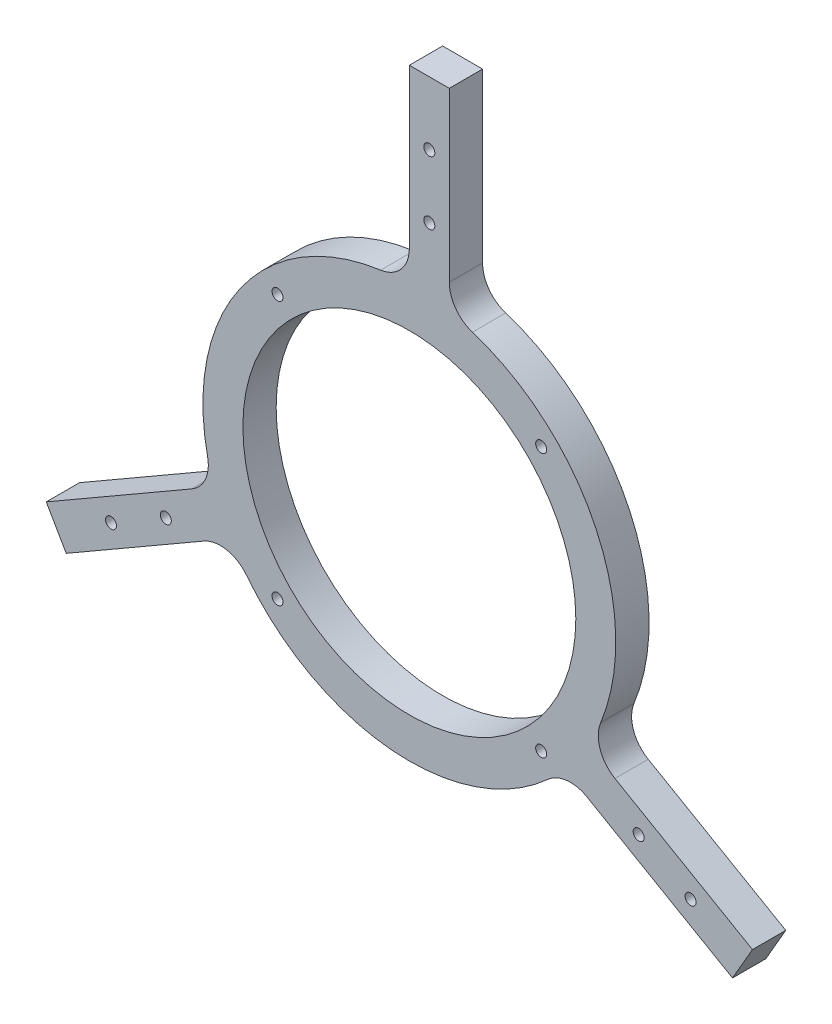
ISO-10303-21;
HEADER;
FILE_DESCRIPTION(('STEP AP214'),'2;1');
FILE_NAME('part.step','',(''),(''),'','','');
FILE_SCHEMA(('AUTOMOTIVE_DESIGN { 1 0 10303 214 1 1 1 1 }'));
ENDSEC;
DATA;
#1=APPLICATION_CONTEXT('core data for automotive mechanical design processes');
#2=APPLICATION_PROTOCOL_DEFINITION('international standard','automotive_design',2000,#1);
#3=PRODUCT_CONTEXT('',#1,'mechanical');
#4=PRODUCT('Part','Part','',(#3));
#5=PRODUCT_RELATED_PRODUCT_CATEGORY('part','',(#4));
#6=PRODUCT_DEFINITION_FORMATION('','',#4);
#7=PRODUCT_DEFINITION_CONTEXT('part definition',#1,'design');
#8=PRODUCT_DEFINITION('design','',#6,#7);
#9=PRODUCT_DEFINITION_SHAPE('','',#8);
#10=(LENGTH_UNIT() NAMED_UNIT(*) SI_UNIT(.MILLI.,.METRE.));
#11=(NAMED_UNIT(*) PLANE_ANGLE_UNIT() SI_UNIT($,.RADIAN.));
#12=(NAMED_UNIT(*) SI_UNIT($,.STERADIAN.) SOLID_ANGLE_UNIT());
#13=UNCERTAINTY_MEASURE_WITH_UNIT(LENGTH_MEASURE(1.E-05),#10,'distance_accuracy_value','');
#14=(GEOMETRIC_REPRESENTATION_CONTEXT(3) GLOBAL_UNCERTAINTY_ASSIGNED_CONTEXT((#13)) GLOBAL_UNIT_ASSIGNED_CONTEXT((#10,
#11,#12)) REPRESENTATION_CONTEXT('',''));
#15=CARTESIAN_POINT('',(0.,0.,0.));
#16=DIRECTION('',(0.,0.,1.));
#17=DIRECTION('',(1.,0.,0.));
#18=AXIS2_PLACEMENT_3D('',#15,#16,#17);
#19=CARTESIAN_POINT('',(0.,0.,10.));
#20=DIRECTION('',(0.5,-0.866025403784438,0.));
#21=DIRECTION('',(0.866025403784438,0.5,0.));
#22=AXIS2_PLACEMENT_3D('',#19,#20,#21);
#23=PLANE('',#22);
#24=DIRECTION('',(-0.866025403784438,-0.5,0.));
#25=VECTOR('',#24,1.);
#26=CARTESIAN_POINT('',(0.,0.,0.));
#27=LINE('',#26,#25);
#28=CARTESIAN_POINT('',(-61.7494939250517,-35.6510869399518,0.));
#29=VERTEX_POINT('',#28);
#30=CARTESIAN_POINT('',(-103.057023050348,-59.5000000000001,0.));
#31=VERTEX_POINT('',#30);
#32=EDGE_CURVE('E240',#29,#31,#27,.T.);
#33=ORIENTED_EDGE('',*,*,#32,.F.);
#34=DIRECTION('',(0.,0.,-1.));
#35=VECTOR('',#34,1.);
#36=CARTESIAN_POINT('',(-61.7494939250517,-35.6510869399518,10.));
#37=LINE('',#36,#35);
#38=CARTESIAN_POINT('',(-61.7494939250517,-35.6510869399518,10.));
#39=VERTEX_POINT('',#38);
#40=EDGE_CURVE('E381',#29,#39,#37,.F.);
#41=ORIENTED_EDGE('',*,*,#40,.T.);
#42=DIRECTION('',(-0.866025403784438,-0.5,0.));
#43=VECTOR('',#42,1.);
#44=CARTESIAN_POINT('',(0.,0.,10.));
#45=LINE('',#44,#43);
#46=CARTESIAN_POINT('',(-103.057023050348,-59.5000000000001,10.));
#47=VERTEX_POINT('',#46);
#48=EDGE_CURVE('E204',#39,#47,#45,.T.);
#49=ORIENTED_EDGE('',*,*,#48,.T.);
#50=DIRECTION('',(0.,0.,-1.));
#51=VECTOR('',#50,1.);
#52=CARTESIAN_POINT('',(-103.057023050348,-59.5000000000001,10.));
#53=LINE('',#52,#51);
#54=EDGE_CURVE('E235',#47,#31,#53,.T.);
#55=ORIENTED_EDGE('',*,*,#54,.T.);
#56=EDGE_LOOP('',(#33,#41,#49,#55));
#57=FACE_BOUND('',#56,.T.);
#58=ADVANCED_FACE('F44',(#57),#23,.T.);
#59=CARTESIAN_POINT('',(0.,0.,10.));
#60=DIRECTION('',(0.,0.,-1.));
#61=DIRECTION('',(-1.,0.,0.));
#62=AXIS2_PLACEMENT_3D('',#59,#60,#61);
#63=CYLINDRICAL_SURFACE('',#62,62.);
#64=CARTESIAN_POINT('',(0.,0.,0.));
#65=DIRECTION('',(0.,0.,1.));
#66=DIRECTION('',(1.,0.,0.));
#67=AXIS2_PLACEMENT_3D('',#64,#65,#66);
#68=CIRCLE('',#67,62.);
#69=CARTESIAN_POINT('',(-48.8676197687945,-38.1569880642134,0.));
#70=VERTEX_POINT('',#69);
#71=CARTESIAN_POINT('',(41.653417319191,-45.9237719011986,0.));
#72=VERTEX_POINT('',#71);
#73=EDGE_CURVE('E244',#70,#72,#68,.T.);
#74=ORIENTED_EDGE('',*,*,#73,.T.);
#75=DIRECTION('',(0.,0.,-1.));
#76=VECTOR('',#75,1.);
#77=CARTESIAN_POINT('',(41.653417319191,-45.9237719011986,10.));
#78=LINE('',#77,#76);
#79=CARTESIAN_POINT('',(41.653417319191,-45.9237719011986,10.));
#80=VERTEX_POINT('',#79);
#81=EDGE_CURVE('E378',#72,#80,#78,.F.);
#82=ORIENTED_EDGE('',*,*,#81,.T.);
#83=CARTESIAN_POINT('',(0.,0.,10.));
#84=DIRECTION('',(0.,0.,1.));
#85=DIRECTION('',(1.,0.,0.));
#86=AXIS2_PLACEMENT_3D('',#83,#84,#85);
#87=CIRCLE('',#86,62.);
#88=CARTESIAN_POINT('',(-48.8676197687945,-38.1569880642134,10.));
#89=VERTEX_POINT('',#88);
#90=EDGE_CURVE('E201',#89,#80,#87,.T.);
#91=ORIENTED_EDGE('',*,*,#90,.F.);
#92=DIRECTION('',(0.,0.,-1.));
#93=VECTOR('',#92,1.);
#94=CARTESIAN_POINT('',(-48.8676197687945,-38.1569880642134,10.));
#95=LINE('',#94,#93);
#96=EDGE_CURVE('E374',#89,#70,#95,.T.);
#97=ORIENTED_EDGE('',*,*,#96,.T.);
#98=EDGE_LOOP('',(#74,#82,#91,#97));
#99=FACE_BOUND('',#98,.T.);
#100=ADVANCED_FACE('F518',(#99),#63,.T.);
#101=CARTESIAN_POINT('',(-6.00000000000004,-10.3923048454133,10.));
#102=DIRECTION('',(-0.5,-0.866025403784439,0.));
#103=DIRECTION('',(0.866025403784439,-0.5,0.));
#104=AXIS2_PLACEMENT_3D('',#101,#102,#103);
#105=PLANE('',#104);
#106=DIRECTION('',(-0.866025403784439,0.5,0.));
#107=VECTOR('',#106,1.);
#108=CARTESIAN_POINT('',(-6.00000000000004,-10.3923048454133,10.));
#109=LINE('',#108,#107);
#110=CARTESIAN_POINT('',(97.0570230503482,-69.8923048454133,10.));
#111=VERTEX_POINT('',#110);
#112=CARTESIAN_POINT('',(53.3717104351896,-44.6705778474185,10.));
#113=VERTEX_POINT('',#112);
#114=EDGE_CURVE('E175',#111,#113,#109,.T.);
#115=ORIENTED_EDGE('',*,*,#114,.T.);
#116=DIRECTION('',(0.,0.,-1.));
#117=VECTOR('',#116,1.);
#118=CARTESIAN_POINT('',(53.3717104351896,-44.6705778474185,10.));
#119=LINE('',#118,#117);
#120=CARTESIAN_POINT('',(53.3717104351896,-44.6705778474185,0.));
#121=VERTEX_POINT('',#120);
#122=EDGE_CURVE('E371',#113,#121,#119,.T.);
#123=ORIENTED_EDGE('',*,*,#122,.T.);
#124=DIRECTION('',(-0.866025403784439,0.5,0.));
#125=VECTOR('',#124,1.);
#126=CARTESIAN_POINT('',(-6.00000000000004,-10.3923048454133,0.));
#127=LINE('',#126,#125);
#128=CARTESIAN_POINT('',(97.0570230503482,-69.8923048454133,0.));
#129=VERTEX_POINT('',#128);
#130=EDGE_CURVE('E178',#129,#121,#127,.T.);
#131=ORIENTED_EDGE('',*,*,#130,.F.);
#132=DIRECTION('',(0.,0.,-1.));
#133=VECTOR('',#132,1.);
#134=CARTESIAN_POINT('',(97.0570230503482,-69.8923048454133,10.));
#135=LINE('',#134,#133);
#136=EDGE_CURVE('E170',#111,#129,#135,.T.);
#137=ORIENTED_EDGE('',*,*,#136,.F.);
#138=EDGE_LOOP('',(#115,#123,#131,#137));
#139=FACE_BOUND('',#138,.T.);
#140=ADVANCED_FACE('F172',(#139),#105,.T.);
#141=CARTESIAN_POINT('',(103.057023050348,-59.4999999999998,10.));
#142=DIRECTION('',(-0.866025403784439,0.499999999999999,0.));
#143=DIRECTION('',(-0.499999999999999,-0.86602540378444,0.));
#144=AXIS2_PLACEMENT_3D('',#141,#142,#143);
#145=PLANE('',#144);
#146=DIRECTION('',(0.499999999999999,0.86602540378444,0.));
#147=VECTOR('',#146,1.);
#148=CARTESIAN_POINT('',(103.057023050348,-59.4999999999998,0.));
#149=LINE('',#148,#147);
#150=CARTESIAN_POINT('',(103.057023050348,-59.4999999999999,0.));
#151=VERTEX_POINT('',#150);
#152=EDGE_CURVE('E250',#129,#151,#149,.T.);
#153=ORIENTED_EDGE('',*,*,#152,.T.);
#154=DIRECTION('',(0.,0.,-1.));
#155=VECTOR('',#154,1.);
#156=CARTESIAN_POINT('',(103.057023050348,-59.4999999999999,10.));
#157=LINE('',#156,#155);
#158=CARTESIAN_POINT('',(103.057023050348,-59.4999999999999,10.));
#159=VERTEX_POINT('',#158);
#160=EDGE_CURVE('E184',#159,#151,#157,.T.);
#161=ORIENTED_EDGE('',*,*,#160,.F.);
#162=DIRECTION('',(0.499999999999999,0.86602540378444,0.));
#163=VECTOR('',#162,1.);
#164=CARTESIAN_POINT('',(103.057023050348,-59.4999999999998,10.));
#165=LINE('',#164,#163);
#166=EDGE_CURVE('E188',#111,#159,#165,.T.);
#167=ORIENTED_EDGE('',*,*,#166,.F.);
#168=ORIENTED_EDGE('',*,*,#136,.T.);
#169=EDGE_LOOP('',(#153,#161,#167,#168));
#170=FACE_BOUND('',#169,.T.);
#171=ADVANCED_FACE('F189',(#170),#145,.F.);
#172=CARTESIAN_POINT('',(0.,0.,10.));
#173=DIRECTION('',(0.5,0.866025403784439,0.));
#174=DIRECTION('',(-0.866025403784439,0.5,0.));
#175=AXIS2_PLACEMENT_3D('',#172,#173,#174);
#176=PLANE('',#175);
#177=DIRECTION('',(0.866025403784439,-0.5,0.));
#178=VECTOR('',#177,1.);
#179=CARTESIAN_POINT('',(0.,0.,0.));
#180=LINE('',#179,#178);
#181=CARTESIAN_POINT('',(61.7494939250518,-35.6510869399517,0.));
#182=VERTEX_POINT('',#181);
#183=EDGE_CURVE('E253',#182,#151,#180,.T.);
#184=ORIENTED_EDGE('',*,*,#183,.F.);
#185=DIRECTION('',(0.,0.,-1.));
#186=VECTOR('',#185,1.);
#187=CARTESIAN_POINT('',(61.7494939250518,-35.6510869399517,10.));
#188=LINE('',#187,#186);
#189=CARTESIAN_POINT('',(61.7494939250518,-35.6510869399517,10.));
#190=VERTEX_POINT('',#189);
#191=EDGE_CURVE('E368',#182,#190,#188,.F.);
#192=ORIENTED_EDGE('',*,*,#191,.T.);
#193=DIRECTION('',(0.866025403784439,-0.5,0.));
#194=VECTOR('',#193,1.);
#195=CARTESIAN_POINT('',(0.,0.,10.));
#196=LINE('',#195,#194);
#197=EDGE_CURVE('E193',#190,#159,#196,.T.);
#198=ORIENTED_EDGE('',*,*,#197,.T.);
#199=ORIENTED_EDGE('',*,*,#160,.T.);
#200=EDGE_LOOP('',(#184,#192,#198,#199));
#201=FACE_BOUND('',#200,.T.);
#202=ADVANCED_FACE('F556',(#201),#176,.T.);
#203=CARTESIAN_POINT('',(0.,0.,10.));
#204=DIRECTION('',(0.,0.,-1.));
#205=DIRECTION('',(-1.,0.,0.));
#206=AXIS2_PLACEMENT_3D('',#203,#204,#205);
#207=CYLINDRICAL_SURFACE('',#206,62.);
#208=CARTESIAN_POINT('',(0.,0.,0.));
#209=DIRECTION('',(0.,0.,1.));
#210=DIRECTION('',(1.,0.,0.));
#211=AXIS2_PLACEMENT_3D('',#208,#209,#210);
#212=CIRCLE('',#211,62.);
#213=CARTESIAN_POINT('',(57.4787308799057,-23.242106110148,0.));
#214=VERTEX_POINT('',#213);
#215=CARTESIAN_POINT('',(18.9444444444445,59.0348035034534,0.));
#216=VERTEX_POINT('',#215);
#217=EDGE_CURVE('E256',#214,#216,#212,.T.);
#218=ORIENTED_EDGE('',*,*,#217,.T.);
#219=DIRECTION('',(0.,0.,-1.));
#220=VECTOR('',#219,1.);
#221=CARTESIAN_POINT('',(18.9444444444445,59.0348035034534,10.));
#222=LINE('',#221,#220);
#223=CARTESIAN_POINT('',(18.9444444444445,59.0348035034534,10.));
#224=VERTEX_POINT('',#223);
#225=EDGE_CURVE('E365',#216,#224,#222,.F.);
#226=ORIENTED_EDGE('',*,*,#225,.T.);
#227=CARTESIAN_POINT('',(0.,0.,10.));
#228=DIRECTION('',(0.,0.,1.));
#229=DIRECTION('',(1.,0.,0.));
#230=AXIS2_PLACEMENT_3D('',#227,#228,#229);
#231=CIRCLE('',#230,62.);
#232=CARTESIAN_POINT('',(57.4787308799057,-23.242106110148,10.));
#233=VERTEX_POINT('',#232);
#234=EDGE_CURVE('E210',#233,#224,#231,.T.);
#235=ORIENTED_EDGE('',*,*,#234,.F.);
#236=DIRECTION('',(0.,0.,-1.));
#237=VECTOR('',#236,1.);
#238=CARTESIAN_POINT('',(57.4787308799057,-23.242106110148,10.));
#239=LINE('',#238,#237);
#240=EDGE_CURVE('E361',#233,#214,#239,.T.);
#241=ORIENTED_EDGE('',*,*,#240,.T.);
#242=EDGE_LOOP('',(#218,#226,#235,#241));
#243=FACE_BOUND('',#242,.T.);
#244=ADVANCED_FACE('F561',(#243),#207,.T.);
#245=CARTESIAN_POINT('',(12.,0.,10.));
#246=DIRECTION('',(1.,0.,0.));
#247=DIRECTION('',(0.,1.,0.));
#248=AXIS2_PLACEMENT_3D('',#245,#246,#247);
#249=PLANE('',#248);
#250=DIRECTION('',(0.,-1.,0.));
#251=VECTOR('',#250,1.);
#252=CARTESIAN_POINT('',(12.,0.,10.));
#253=LINE('',#252,#251);
#254=CARTESIAN_POINT('',(12.,119.,10.));
#255=VERTEX_POINT('',#254);
#256=CARTESIAN_POINT('',(12.,68.5565460040104,10.));
#257=VERTEX_POINT('',#256);
#258=EDGE_CURVE('E214',#255,#257,#253,.T.);
#259=ORIENTED_EDGE('',*,*,#258,.T.);
#260=DIRECTION('',(0.,0.,-1.));
#261=VECTOR('',#260,1.);
#262=CARTESIAN_POINT('',(12.,68.5565460040104,10.));
#263=LINE('',#262,#261);
#264=CARTESIAN_POINT('',(12.,68.5565460040104,0.));
#265=VERTEX_POINT('',#264);
#266=EDGE_CURVE('E357',#257,#265,#263,.T.);
#267=ORIENTED_EDGE('',*,*,#266,.T.);
#268=DIRECTION('',(0.,-1.,0.));
#269=VECTOR('',#268,1.);
#270=CARTESIAN_POINT('',(12.,0.,0.));
#271=LINE('',#270,#269);
#272=CARTESIAN_POINT('',(12.,119.,0.));
#273=VERTEX_POINT('',#272);
#274=EDGE_CURVE('E260',#273,#265,#271,.T.);
#275=ORIENTED_EDGE('',*,*,#274,.F.);
#276=DIRECTION('',(0.,0.,-1.));
#277=VECTOR('',#276,1.);
#278=CARTESIAN_POINT('',(12.,119.,10.));
#279=LINE('',#278,#277);
#280=EDGE_CURVE('E294',#255,#273,#279,.T.);
#281=ORIENTED_EDGE('',*,*,#280,.F.);
#282=EDGE_LOOP('',(#259,#267,#275,#281));
#283=FACE_BOUND('',#282,.T.);
#284=ADVANCED_FACE('F567',(#283),#249,.T.);
#285=CARTESIAN_POINT('',(0.,119.,10.));
#286=DIRECTION('',(0.,1.,0.));
#287=DIRECTION('',(0.,0.,1.));
#288=AXIS2_PLACEMENT_3D('',#285,#286,#287);
#289=PLANE('',#288);
#290=DIRECTION('',(1.,0.,0.));
#291=VECTOR('',#290,1.);
#292=CARTESIAN_POINT('',(0.,119.,0.));
#293=LINE('',#292,#291);
#294=CARTESIAN_POINT('',(0.,119.,0.));
#295=VERTEX_POINT('',#294);
#296=EDGE_CURVE('E264',#295,#273,#293,.T.);
#297=ORIENTED_EDGE('',*,*,#296,.F.);
#298=DIRECTION('',(0.,0.,-1.));
#299=VECTOR('',#298,1.);
#300=CARTESIAN_POINT('',(0.,119.,10.));
#301=LINE('',#300,#299);
#302=CARTESIAN_POINT('',(0.,119.,10.));
#303=VERTEX_POINT('',#302);
#304=EDGE_CURVE('E290',#303,#295,#301,.T.);
#305=ORIENTED_EDGE('',*,*,#304,.F.);
#306=DIRECTION('',(1.,0.,0.));
#307=VECTOR('',#306,1.);
#308=CARTESIAN_POINT('',(0.,119.,10.));
#309=LINE('',#308,#307);
#310=EDGE_CURVE('E218',#303,#255,#309,.T.);
#311=ORIENTED_EDGE('',*,*,#310,.T.);
#312=ORIENTED_EDGE('',*,*,#280,.T.);
#313=EDGE_LOOP('',(#297,#305,#311,#312));
#314=FACE_BOUND('',#313,.T.);
#315=ADVANCED_FACE('F574',(#314),#289,.T.);
#316=CARTESIAN_POINT('',(0.,0.,10.));
#317=DIRECTION('',(-1.,0.,0.));
#318=DIRECTION('',(0.,-1.,0.));
#319=AXIS2_PLACEMENT_3D('',#316,#317,#318);
#320=PLANE('',#319);
#321=DIRECTION('',(0.,1.,0.));
#322=VECTOR('',#321,1.);
#323=CARTESIAN_POINT('',(0.,0.,0.));
#324=LINE('',#323,#322);
#325=CARTESIAN_POINT('',(0.,71.3021738799035,0.));
#326=VERTEX_POINT('',#325);
#327=EDGE_CURVE('E268',#326,#295,#324,.T.);
#328=ORIENTED_EDGE('',*,*,#327,.F.);
#329=DIRECTION('',(0.,0.,-1.));
#330=VECTOR('',#329,1.);
#331=CARTESIAN_POINT('',(0.,71.3021738799035,10.));
#332=LINE('',#331,#330);
#333=CARTESIAN_POINT('',(0.,71.3021738799035,10.));
#334=VERTEX_POINT('',#333);
#335=EDGE_CURVE('E354',#326,#334,#332,.F.);
#336=ORIENTED_EDGE('',*,*,#335,.T.);
#337=DIRECTION('',(0.,1.,0.));
#338=VECTOR('',#337,1.);
#339=CARTESIAN_POINT('',(0.,0.,10.));
#340=LINE('',#339,#338);
#341=EDGE_CURVE('E222',#334,#303,#340,.T.);
#342=ORIENTED_EDGE('',*,*,#341,.T.);
#343=ORIENTED_EDGE('',*,*,#304,.T.);
#344=EDGE_LOOP('',(#328,#336,#342,#343));
#345=FACE_BOUND('',#344,.T.);
#346=ADVANCED_FACE('F577',(#345),#320,.T.);
#347=CARTESIAN_POINT('',(0.,0.,10.));
#348=DIRECTION('',(0.,0.,-1.));
#349=DIRECTION('',(-1.,0.,0.));
#350=AXIS2_PLACEMENT_3D('',#347,#348,#349);
#351=CYLINDRICAL_SURFACE('',#350,62.);
#352=CARTESIAN_POINT('',(0.,0.,10.));
#353=DIRECTION('',(0.,0.,1.));
#354=DIRECTION('',(1.,0.,0.));
#355=AXIS2_PLACEMENT_3D('',#352,#353,#354);
#356=CIRCLE('',#355,62.);
#357=CARTESIAN_POINT('',(-8.61111111111111,61.3990941743614,10.));
#358=VERTEX_POINT('',#357);
#359=CARTESIAN_POINT('',(-60.5978617636355,-13.1110316022549,10.));
#360=VERTEX_POINT('',#359);
#361=EDGE_CURVE('E225',#358,#360,#356,.T.);
#362=ORIENTED_EDGE('',*,*,#361,.F.);
#363=DIRECTION('',(0.,0.,-1.));
#364=VECTOR('',#363,1.);
#365=CARTESIAN_POINT('',(-8.61111111111111,61.3990941743614,10.));
#366=LINE('',#365,#364);
#367=CARTESIAN_POINT('',(-8.61111111111111,61.3990941743614,0.));
#368=VERTEX_POINT('',#367);
#369=EDGE_CURVE('E350',#358,#368,#366,.T.);
#370=ORIENTED_EDGE('',*,*,#369,.T.);
#371=CARTESIAN_POINT('',(0.,0.,0.));
#372=DIRECTION('',(0.,0.,1.));
#373=DIRECTION('',(1.,0.,0.));
#374=AXIS2_PLACEMENT_3D('',#371,#372,#373);
#375=CIRCLE('',#374,62.);
#376=CARTESIAN_POINT('',(-60.5978617636355,-13.1110316022549,0.));
#377=VERTEX_POINT('',#376);
#378=EDGE_CURVE('E271',#368,#377,#375,.T.);
#379=ORIENTED_EDGE('',*,*,#378,.T.);
#380=DIRECTION('',(0.,0.,-1.));
#381=VECTOR('',#380,1.);
#382=CARTESIAN_POINT('',(-60.5978617636355,-13.1110316022549,10.));
#383=LINE('',#382,#381);
#384=EDGE_CURVE('E183',#377,#360,#383,.F.);
#385=ORIENTED_EDGE('',*,*,#384,.T.);
#386=EDGE_LOOP('',(#362,#370,#379,#385));
#387=FACE_BOUND('',#386,.T.);
#388=ADVANCED_FACE('F423',(#387),#351,.T.);
#389=CARTESIAN_POINT('',(-5.99999999999998,10.3923048454132,10.));
#390=DIRECTION('',(-0.5,0.866025403784439,0.));
#391=DIRECTION('',(-0.866025403784439,-0.5,0.));
#392=AXIS2_PLACEMENT_3D('',#389,#390,#391);
#393=PLANE('',#392);
#394=DIRECTION('',(0.866025403784439,0.5,0.));
#395=VECTOR('',#394,1.);
#396=CARTESIAN_POINT('',(-5.99999999999998,10.3923048454132,10.));
#397=LINE('',#396,#395);
#398=CARTESIAN_POINT('',(-109.057023050348,-49.1076951545868,10.));
#399=VERTEX_POINT('',#398);
#400=CARTESIAN_POINT('',(-65.3717104351896,-23.885968156592,10.));
#401=VERTEX_POINT('',#400);
#402=EDGE_CURVE('E228',#399,#401,#397,.T.);
#403=ORIENTED_EDGE('',*,*,#402,.T.);
#404=DIRECTION('',(0.,0.,-1.));
#405=VECTOR('',#404,1.);
#406=CARTESIAN_POINT('',(-65.3717104351896,-23.885968156592,10.));
#407=LINE('',#406,#405);
#408=CARTESIAN_POINT('',(-65.3717104351896,-23.885968156592,0.));
#409=VERTEX_POINT('',#408);
#410=EDGE_CURVE('E384',#401,#409,#407,.T.);
#411=ORIENTED_EDGE('',*,*,#410,.T.);
#412=DIRECTION('',(0.866025403784439,0.5,0.));
#413=VECTOR('',#412,1.);
#414=CARTESIAN_POINT('',(-5.99999999999998,10.3923048454132,0.));
#415=LINE('',#414,#413);
#416=CARTESIAN_POINT('',(-109.057023050348,-49.1076951545868,0.));
#417=VERTEX_POINT('',#416);
#418=EDGE_CURVE('E275',#417,#409,#415,.T.);
#419=ORIENTED_EDGE('',*,*,#418,.F.);
#420=DIRECTION('',(0.,0.,-1.));
#421=VECTOR('',#420,1.);
#422=CARTESIAN_POINT('',(-109.057023050348,-49.1076951545868,10.));
#423=LINE('',#422,#421);
#424=EDGE_CURVE('E287',#399,#417,#423,.T.);
#425=ORIENTED_EDGE('',*,*,#424,.F.);
#426=EDGE_LOOP('',(#403,#411,#419,#425));
#427=FACE_BOUND('',#426,.T.);
#428=ADVANCED_FACE('F426',(#427),#393,.T.);
#429=CARTESIAN_POINT('',(0.,0.,10.));
#430=DIRECTION('',(0.,0.,-1.));
#431=DIRECTION('',(-1.,0.,0.));
#432=AXIS2_PLACEMENT_3D('',#429,#430,#431);
#433=CYLINDRICAL_SURFACE('',#432,50.);
#434=CARTESIAN_POINT('',(0.,0.,10.));
#435=DIRECTION('',(0.,0.,1.));
#436=DIRECTION('',(1.,0.,0.));
#437=AXIS2_PLACEMENT_3D('',#434,#435,#436);
#438=CIRCLE('',#437,50.);
#439=CARTESIAN_POINT('',(50.,0.,10.));
#440=VERTEX_POINT('',#439);
#441=EDGE_CURVE('E283',#440,#440,#438,.T.);
#442=ORIENTED_EDGE('',*,*,#441,.T.);
#443=EDGE_LOOP('',(#442));
#444=FACE_BOUND('',#443,.T.);
#445=CARTESIAN_POINT('',(0.,0.,0.));
#446=DIRECTION('',(0.,0.,1.));
#447=DIRECTION('',(1.,0.,0.));
#448=AXIS2_PLACEMENT_3D('',#445,#446,#447);
#449=CIRCLE('',#448,50.);
#450=CARTESIAN_POINT('',(50.,0.,0.));
#451=VERTEX_POINT('',#450);
#452=EDGE_CURVE('E236',#451,#451,#449,.T.);
#453=ORIENTED_EDGE('',*,*,#452,.F.);
#454=EDGE_LOOP('',(#453));
#455=FACE_BOUND('',#454,.T.);
#456=ADVANCED_FACE('F498',(#444,#455),#433,.F.);
#457=CARTESIAN_POINT('',(-103.057023050348,-59.5000000000001,10.));
#458=DIRECTION('',(-0.866025403784438,-0.500000000000001,0.));
#459=DIRECTION('',(0.500000000000001,-0.866025403784438,0.));
#460=AXIS2_PLACEMENT_3D('',#457,#458,#459);
#461=PLANE('',#460);
#462=DIRECTION('',(-0.500000000000001,0.866025403784438,0.));
#463=VECTOR('',#462,1.);
#464=CARTESIAN_POINT('',(-103.057023050348,-59.5000000000001,0.));
#465=LINE('',#464,#463);
#466=EDGE_CURVE('E279',#31,#417,#465,.T.);
#467=ORIENTED_EDGE('',*,*,#466,.F.);
#468=ORIENTED_EDGE('',*,*,#54,.F.);
#469=DIRECTION('',(-0.500000000000001,0.866025403784438,0.));
#470=VECTOR('',#469,1.);
#471=CARTESIAN_POINT('',(-103.057023050348,-59.5000000000001,10.));
#472=LINE('',#471,#470);
#473=EDGE_CURVE('E231',#47,#399,#472,.T.);
#474=ORIENTED_EDGE('',*,*,#473,.T.);
#475=ORIENTED_EDGE('',*,*,#424,.T.);
#476=EDGE_LOOP('',(#467,#468,#474,#475));
#477=FACE_BOUND('',#476,.T.);
#478=ADVANCED_FACE('F431',(#477),#461,.T.);
#479=CARTESIAN_POINT('',(0.,0.,10.));
#480=DIRECTION('',(0.,0.,1.));
#481=DIRECTION('',(1.,0.,0.));
#482=AXIS2_PLACEMENT_3D('',#479,#480,#481);
#483=PLANE('',#482);
#484=CARTESIAN_POINT('',(-39.5979797464469,39.5979797464465,10.));
#485=DIRECTION('',(0.,0.,1.));
#486=DIRECTION('',(1.,0.,0.));
#487=AXIS2_PLACEMENT_3D('',#484,#485,#486);
#488=CIRCLE('',#487,1.64999999999999);
#489=CARTESIAN_POINT('',(-37.9479797464469,39.5979797464465,10.));
#490=VERTEX_POINT('',#489);
#491=EDGE_CURVE('E347',#490,#490,#488,.T.);
#492=ORIENTED_EDGE('',*,*,#491,.F.);
#493=EDGE_LOOP('',(#492));
#494=FACE_BOUND('',#493,.T.);
#495=CARTESIAN_POINT('',(-39.5979797464463,-39.597979746447,10.));
#496=DIRECTION('',(0.,0.,1.));
#497=DIRECTION('',(1.,0.,0.));
#498=AXIS2_PLACEMENT_3D('',#495,#496,#497);
#499=CIRCLE('',#498,1.64999999999999);
#500=CARTESIAN_POINT('',(-37.9479797464463,-39.597979746447,10.));
#501=VERTEX_POINT('',#500);
#502=EDGE_CURVE('E342',#501,#501,#499,.T.);
#503=ORIENTED_EDGE('',*,*,#502,.F.);
#504=EDGE_LOOP('',(#503));
#505=FACE_BOUND('',#504,.T.);
#506=CARTESIAN_POINT('',(39.5979797464467,-39.5979797464466,10.));
#507=DIRECTION('',(0.,0.,1.));
#508=DIRECTION('',(1.,0.,0.));
#509=AXIS2_PLACEMENT_3D('',#506,#507,#508);
#510=CIRCLE('',#509,1.64999999999999);
#511=CARTESIAN_POINT('',(41.2479797464467,-39.5979797464466,10.));
#512=VERTEX_POINT('',#511);
#513=EDGE_CURVE('E337',#512,#512,#510,.T.);
#514=ORIENTED_EDGE('',*,*,#513,.F.);
#515=EDGE_LOOP('',(#514));
#516=FACE_BOUND('',#515,.T.);
#517=CARTESIAN_POINT('',(39.5979797464466,39.5979797464467,10.));
#518=DIRECTION('',(0.,0.,1.));
#519=DIRECTION('',(1.,0.,0.));
#520=AXIS2_PLACEMENT_3D('',#517,#518,#519);
#521=CIRCLE('',#520,1.64999999999999);
#522=CARTESIAN_POINT('',(41.2479797464466,39.5979797464467,10.));
#523=VERTEX_POINT('',#522);
#524=EDGE_CURVE('E332',#523,#523,#521,.T.);
#525=ORIENTED_EDGE('',*,*,#524,.F.);
#526=EDGE_LOOP('',(#525));
#527=FACE_BOUND('',#526,.T.);
#528=CARTESIAN_POINT('',(-89.6025403784439,-44.8038475772934,10.));
#529=DIRECTION('',(0.,0.,1.));
#530=DIRECTION('',(1.,0.,0.));
#531=AXIS2_PLACEMENT_3D('',#528,#529,#530);
#532=CIRCLE('',#531,1.64999999999998);
#533=CARTESIAN_POINT('',(-87.9525403784439,-44.8038475772934,10.));
#534=VERTEX_POINT('',#533);
#535=EDGE_CURVE('E327',#534,#534,#532,.T.);
#536=ORIENTED_EDGE('',*,*,#535,.F.);
#537=EDGE_LOOP('',(#536));
#538=FACE_BOUND('',#537,.T.);
#539=CARTESIAN_POINT('',(-73.1480577065395,-35.3038475772934,10.));
#540=DIRECTION('',(0.,0.,1.));
#541=DIRECTION('',(1.,0.,0.));
#542=AXIS2_PLACEMENT_3D('',#539,#540,#541);
#543=CIRCLE('',#542,1.64999999999998);
#544=CARTESIAN_POINT('',(-71.4980577065396,-35.3038475772934,10.));
#545=VERTEX_POINT('',#544);
#546=EDGE_CURVE('E322',#545,#545,#543,.T.);
#547=ORIENTED_EDGE('',*,*,#546,.F.);
#548=EDGE_LOOP('',(#547));
#549=FACE_BOUND('',#548,.T.);
#550=CARTESIAN_POINT('',(84.4685657822283,-55.6961524227066,10.));
#551=DIRECTION('',(0.,0.,1.));
#552=DIRECTION('',(1.,0.,0.));
#553=AXIS2_PLACEMENT_3D('',#550,#551,#552);
#554=CIRCLE('',#553,1.64999999999998);
#555=CARTESIAN_POINT('',(86.1185657822283,-55.6961524227066,10.));
#556=VERTEX_POINT('',#555);
#557=EDGE_CURVE('E317',#556,#556,#554,.T.);
#558=ORIENTED_EDGE('',*,*,#557,.F.);
#559=EDGE_LOOP('',(#558));
#560=FACE_BOUND('',#559,.T.);
#561=CARTESIAN_POINT('',(68.8801085141084,-46.6961524227066,10.));
#562=DIRECTION('',(0.,0.,1.));
#563=DIRECTION('',(1.,0.,0.));
#564=AXIS2_PLACEMENT_3D('',#561,#562,#563);
#565=CIRCLE('',#564,1.64999999999998);
#566=CARTESIAN_POINT('',(70.5301085141084,-46.6961524227066,10.));
#567=VERTEX_POINT('',#566);
#568=EDGE_CURVE('E312',#567,#567,#565,.T.);
#569=ORIENTED_EDGE('',*,*,#568,.F.);
#570=EDGE_LOOP('',(#569));
#571=FACE_BOUND('',#570,.T.);
#572=CARTESIAN_POINT('',(6.00000000000001,81.,10.));
#573=DIRECTION('',(0.,0.,1.));
#574=DIRECTION('',(1.,0.,0.));
#575=AXIS2_PLACEMENT_3D('',#572,#573,#574);
#576=CIRCLE('',#575,1.64999999999999);
#577=CARTESIAN_POINT('',(7.65,81.,10.));
#578=VERTEX_POINT('',#577);
#579=EDGE_CURVE('E307',#578,#578,#576,.T.);
#580=ORIENTED_EDGE('',*,*,#579,.F.);
#581=EDGE_LOOP('',(#580));
#582=FACE_BOUND('',#581,.T.);
#583=CARTESIAN_POINT('',(6.00000000000001,100.,10.));
#584=DIRECTION('',(0.,0.,1.));
#585=DIRECTION('',(1.,0.,0.));
#586=AXIS2_PLACEMENT_3D('',#583,#584,#585);
#587=CIRCLE('',#586,1.64999999999999);
#588=CARTESIAN_POINT('',(7.65,100.,10.));
#589=VERTEX_POINT('',#588);
#590=EDGE_CURVE('E302',#589,#589,#587,.T.);
#591=ORIENTED_EDGE('',*,*,#590,.F.);
#592=EDGE_LOOP('',(#591));
#593=FACE_BOUND('',#592,.T.);
#594=ORIENTED_EDGE('',*,*,#441,.F.);
#595=EDGE_LOOP('',(#594));
#596=FACE_BOUND('',#595,.T.);
#597=ORIENTED_EDGE('',*,*,#48,.F.);
#598=CARTESIAN_POINT('',(-56.7494939250517,-44.3113409777962,10.));
#599=DIRECTION('',(0.,0.,1.));
#600=DIRECTION('',(1.,0.,0.));
#601=AXIS2_PLACEMENT_3D('',#598,#599,#600);
#602=CIRCLE('',#601,10.);
#603=EDGE_CURVE('E413',#39,#89,#602,.F.);
#604=ORIENTED_EDGE('',*,*,#603,.T.);
#605=ORIENTED_EDGE('',*,*,#90,.T.);
#606=CARTESIAN_POINT('',(48.3717104351895,-53.3308318852629,10.));
#607=DIRECTION('',(0.,0.,1.));
#608=DIRECTION('',(1.,0.,0.));
#609=AXIS2_PLACEMENT_3D('',#606,#607,#608);
#610=CIRCLE('',#609,10.);
#611=EDGE_CURVE('E199',#80,#113,#610,.F.);
#612=ORIENTED_EDGE('',*,*,#611,.T.);
#613=ORIENTED_EDGE('',*,*,#114,.F.);
#614=ORIENTED_EDGE('',*,*,#166,.T.);
#615=ORIENTED_EDGE('',*,*,#197,.F.);
#616=CARTESIAN_POINT('',(66.7494939250518,-26.9908329021073,10.));
#617=DIRECTION('',(0.,0.,1.));
#618=DIRECTION('',(1.,0.,0.));
#619=AXIS2_PLACEMENT_3D('',#616,#617,#618);
#620=CIRCLE('',#619,10.);
#621=EDGE_CURVE('E402',#190,#233,#620,.F.);
#622=ORIENTED_EDGE('',*,*,#621,.T.);
#623=ORIENTED_EDGE('',*,*,#234,.T.);
#624=CARTESIAN_POINT('',(22.,68.5565460040104,10.));
#625=DIRECTION('',(0.,0.,1.));
#626=DIRECTION('',(1.,0.,0.));
#627=AXIS2_PLACEMENT_3D('',#624,#625,#626);
#628=CIRCLE('',#627,10.);
#629=EDGE_CURVE('E396',#224,#257,#628,.F.);
#630=ORIENTED_EDGE('',*,*,#629,.T.);
#631=ORIENTED_EDGE('',*,*,#258,.F.);
#632=ORIENTED_EDGE('',*,*,#310,.F.);
#633=ORIENTED_EDGE('',*,*,#341,.F.);
#634=CARTESIAN_POINT('',(-10.,71.3021738799035,10.));
#635=DIRECTION('',(0.,0.,1.));
#636=DIRECTION('',(1.,0.,0.));
#637=AXIS2_PLACEMENT_3D('',#634,#635,#636);
#638=CIRCLE('',#637,10.);
#639=EDGE_CURVE('E390',#334,#358,#638,.F.);
#640=ORIENTED_EDGE('',*,*,#639,.T.);
#641=ORIENTED_EDGE('',*,*,#361,.T.);
#642=CARTESIAN_POINT('',(-70.3717104351896,-15.2257141187476,10.));
#643=DIRECTION('',(0.,0.,1.));
#644=DIRECTION('',(1.,0.,0.));
#645=AXIS2_PLACEMENT_3D('',#642,#643,#644);
#646=CIRCLE('',#645,10.);
#647=EDGE_CURVE('E11',#360,#401,#646,.F.);
#648=ORIENTED_EDGE('',*,*,#647,.T.);
#649=ORIENTED_EDGE('',*,*,#402,.F.);
#650=ORIENTED_EDGE('',*,*,#473,.F.);
#651=EDGE_LOOP('',(#597,#604,#605,#612,#613,#614,#615,#622,#623,#630,#631,#632,#633,#640,#641,
#648,#649,#650));
#652=FACE_BOUND('',#651,.T.);
#653=ADVANCED_FACE('F196',(#494,#505,#516,#527,#538,#549,#560,#571,#582,#593,#596,#652),#483,.T.);
#654=CARTESIAN_POINT('',(0.,0.,0.));
#655=DIRECTION('',(0.,0.,1.));
#656=DIRECTION('',(1.,0.,0.));
#657=AXIS2_PLACEMENT_3D('',#654,#655,#656);
#658=PLANE('',#657);
#659=CARTESIAN_POINT('',(-39.5979797464469,39.5979797464465,0.));
#660=DIRECTION('',(0.,0.,1.));
#661=DIRECTION('',(1.,0.,0.));
#662=AXIS2_PLACEMENT_3D('',#659,#660,#661);
#663=CIRCLE('',#662,1.64999999999999);
#664=CARTESIAN_POINT('',(-37.9479797464469,39.5979797464465,0.));
#665=VERTEX_POINT('',#664);
#666=EDGE_CURVE('E343',#665,#665,#663,.T.);
#667=ORIENTED_EDGE('',*,*,#666,.T.);
#668=EDGE_LOOP('',(#667));
#669=FACE_BOUND('',#668,.T.);
#670=CARTESIAN_POINT('',(-39.5979797464463,-39.597979746447,0.));
#671=DIRECTION('',(0.,0.,1.));
#672=DIRECTION('',(1.,0.,0.));
#673=AXIS2_PLACEMENT_3D('',#670,#671,#672);
#674=CIRCLE('',#673,1.64999999999999);
#675=CARTESIAN_POINT('',(-37.9479797464463,-39.597979746447,0.));
#676=VERTEX_POINT('',#675);
#677=EDGE_CURVE('E338',#676,#676,#674,.T.);
#678=ORIENTED_EDGE('',*,*,#677,.T.);
#679=EDGE_LOOP('',(#678));
#680=FACE_BOUND('',#679,.T.);
#681=CARTESIAN_POINT('',(39.5979797464467,-39.5979797464466,0.));
#682=DIRECTION('',(0.,0.,1.));
#683=DIRECTION('',(1.,0.,0.));
#684=AXIS2_PLACEMENT_3D('',#681,#682,#683);
#685=CIRCLE('',#684,1.64999999999999);
#686=CARTESIAN_POINT('',(41.2479797464467,-39.5979797464466,0.));
#687=VERTEX_POINT('',#686);
#688=EDGE_CURVE('E333',#687,#687,#685,.T.);
#689=ORIENTED_EDGE('',*,*,#688,.T.);
#690=EDGE_LOOP('',(#689));
#691=FACE_BOUND('',#690,.T.);
#692=CARTESIAN_POINT('',(39.5979797464466,39.5979797464467,0.));
#693=DIRECTION('',(0.,0.,1.));
#694=DIRECTION('',(1.,0.,0.));
#695=AXIS2_PLACEMENT_3D('',#692,#693,#694);
#696=CIRCLE('',#695,1.64999999999999);
#697=CARTESIAN_POINT('',(41.2479797464466,39.5979797464467,0.));
#698=VERTEX_POINT('',#697);
#699=EDGE_CURVE('E328',#698,#698,#696,.T.);
#700=ORIENTED_EDGE('',*,*,#699,.T.);
#701=EDGE_LOOP('',(#700));
#702=FACE_BOUND('',#701,.T.);
#703=CARTESIAN_POINT('',(-89.6025403784439,-44.8038475772934,0.));
#704=DIRECTION('',(0.,0.,1.));
#705=DIRECTION('',(1.,0.,0.));
#706=AXIS2_PLACEMENT_3D('',#703,#704,#705);
#707=CIRCLE('',#706,1.64999999999998);
#708=CARTESIAN_POINT('',(-87.9525403784439,-44.8038475772934,0.));
#709=VERTEX_POINT('',#708);
#710=EDGE_CURVE('E323',#709,#709,#707,.T.);
#711=ORIENTED_EDGE('',*,*,#710,.T.);
#712=EDGE_LOOP('',(#711));
#713=FACE_BOUND('',#712,.T.);
#714=CARTESIAN_POINT('',(-73.1480577065395,-35.3038475772934,0.));
#715=DIRECTION('',(0.,0.,1.));
#716=DIRECTION('',(1.,0.,0.));
#717=AXIS2_PLACEMENT_3D('',#714,#715,#716);
#718=CIRCLE('',#717,1.64999999999998);
#719=CARTESIAN_POINT('',(-71.4980577065396,-35.3038475772934,0.));
#720=VERTEX_POINT('',#719);
#721=EDGE_CURVE('E318',#720,#720,#718,.T.);
#722=ORIENTED_EDGE('',*,*,#721,.T.);
#723=EDGE_LOOP('',(#722));
#724=FACE_BOUND('',#723,.T.);
#725=CARTESIAN_POINT('',(84.4685657822283,-55.6961524227066,0.));
#726=DIRECTION('',(0.,0.,1.));
#727=DIRECTION('',(1.,0.,0.));
#728=AXIS2_PLACEMENT_3D('',#725,#726,#727);
#729=CIRCLE('',#728,1.64999999999998);
#730=CARTESIAN_POINT('',(86.1185657822283,-55.6961524227066,0.));
#731=VERTEX_POINT('',#730);
#732=EDGE_CURVE('E313',#731,#731,#729,.T.);
#733=ORIENTED_EDGE('',*,*,#732,.T.);
#734=EDGE_LOOP('',(#733));
#735=FACE_BOUND('',#734,.T.);
#736=CARTESIAN_POINT('',(68.8801085141084,-46.6961524227066,0.));
#737=DIRECTION('',(0.,0.,1.));
#738=DIRECTION('',(1.,0.,0.));
#739=AXIS2_PLACEMENT_3D('',#736,#737,#738);
#740=CIRCLE('',#739,1.64999999999998);
#741=CARTESIAN_POINT('',(70.5301085141084,-46.6961524227066,0.));
#742=VERTEX_POINT('',#741);
#743=EDGE_CURVE('E308',#742,#742,#740,.T.);
#744=ORIENTED_EDGE('',*,*,#743,.T.);
#745=EDGE_LOOP('',(#744));
#746=FACE_BOUND('',#745,.T.);
#747=CARTESIAN_POINT('',(6.00000000000001,81.,0.));
#748=DIRECTION('',(0.,0.,1.));
#749=DIRECTION('',(1.,0.,0.));
#750=AXIS2_PLACEMENT_3D('',#747,#748,#749);
#751=CIRCLE('',#750,1.64999999999999);
#752=CARTESIAN_POINT('',(7.65,81.,0.));
#753=VERTEX_POINT('',#752);
#754=EDGE_CURVE('E303',#753,#753,#751,.T.);
#755=ORIENTED_EDGE('',*,*,#754,.T.);
#756=EDGE_LOOP('',(#755));
#757=FACE_BOUND('',#756,.T.);
#758=CARTESIAN_POINT('',(6.00000000000001,100.,0.));
#759=DIRECTION('',(0.,0.,1.));
#760=DIRECTION('',(1.,0.,0.));
#761=AXIS2_PLACEMENT_3D('',#758,#759,#760);
#762=CIRCLE('',#761,1.64999999999999);
#763=CARTESIAN_POINT('',(7.65,100.,0.));
#764=VERTEX_POINT('',#763);
#765=EDGE_CURVE('E241',#764,#764,#762,.T.);
#766=ORIENTED_EDGE('',*,*,#765,.T.);
#767=EDGE_LOOP('',(#766));
#768=FACE_BOUND('',#767,.T.);
#769=ORIENTED_EDGE('',*,*,#452,.T.);
#770=EDGE_LOOP('',(#769));
#771=FACE_BOUND('',#770,.T.);
#772=ORIENTED_EDGE('',*,*,#73,.F.);
#773=CARTESIAN_POINT('',(-56.7494939250517,-44.3113409777962,0.));
#774=DIRECTION('',(0.,0.,1.));
#775=DIRECTION('',(1.,0.,0.));
#776=AXIS2_PLACEMENT_3D('',#773,#774,#775);
#777=CIRCLE('',#776,10.);
#778=EDGE_CURVE('E410',#70,#29,#777,.T.);
#779=ORIENTED_EDGE('',*,*,#778,.T.);
#780=ORIENTED_EDGE('',*,*,#32,.T.);
#781=ORIENTED_EDGE('',*,*,#466,.T.);
#782=ORIENTED_EDGE('',*,*,#418,.T.);
#783=CARTESIAN_POINT('',(-70.3717104351896,-15.2257141187476,0.));
#784=DIRECTION('',(0.,0.,1.));
#785=DIRECTION('',(1.,0.,0.));
#786=AXIS2_PLACEMENT_3D('',#783,#784,#785);
#787=CIRCLE('',#786,10.);
#788=EDGE_CURVE('E53',#409,#377,#787,.T.);
#789=ORIENTED_EDGE('',*,*,#788,.T.);
#790=ORIENTED_EDGE('',*,*,#378,.F.);
#791=CARTESIAN_POINT('',(-10.,71.3021738799035,0.));
#792=DIRECTION('',(0.,0.,1.));
#793=DIRECTION('',(1.,0.,0.));
#794=AXIS2_PLACEMENT_3D('',#791,#792,#793);
#795=CIRCLE('',#794,10.);
#796=EDGE_CURVE('E387',#368,#326,#795,.T.);
#797=ORIENTED_EDGE('',*,*,#796,.T.);
#798=ORIENTED_EDGE('',*,*,#327,.T.);
#799=ORIENTED_EDGE('',*,*,#296,.T.);
#800=ORIENTED_EDGE('',*,*,#274,.T.);
#801=CARTESIAN_POINT('',(22.,68.5565460040104,0.));
#802=DIRECTION('',(0.,0.,1.));
#803=DIRECTION('',(1.,0.,0.));
#804=AXIS2_PLACEMENT_3D('',#801,#802,#803);
#805=CIRCLE('',#804,10.);
#806=EDGE_CURVE('E393',#265,#216,#805,.T.);
#807=ORIENTED_EDGE('',*,*,#806,.T.);
#808=ORIENTED_EDGE('',*,*,#217,.F.);
#809=CARTESIAN_POINT('',(66.7494939250518,-26.9908329021073,0.));
#810=DIRECTION('',(0.,0.,1.));
#811=DIRECTION('',(1.,0.,0.));
#812=AXIS2_PLACEMENT_3D('',#809,#810,#811);
#813=CIRCLE('',#812,10.);
#814=EDGE_CURVE('E399',#214,#182,#813,.T.);
#815=ORIENTED_EDGE('',*,*,#814,.T.);
#816=ORIENTED_EDGE('',*,*,#183,.T.);
#817=ORIENTED_EDGE('',*,*,#152,.F.);
#818=ORIENTED_EDGE('',*,*,#130,.T.);
#819=CARTESIAN_POINT('',(48.3717104351895,-53.3308318852629,0.));
#820=DIRECTION('',(0.,0.,1.));
#821=DIRECTION('',(1.,0.,0.));
#822=AXIS2_PLACEMENT_3D('',#819,#820,#821);
#823=CIRCLE('',#822,10.);
#824=EDGE_CURVE('E405',#121,#72,#823,.T.);
#825=ORIENTED_EDGE('',*,*,#824,.T.);
#826=EDGE_LOOP('',(#772,#779,#780,#781,#782,#789,#790,#797,#798,#799,#800,#807,#808,#815,#816,
#817,#818,#825));
#827=FACE_BOUND('',#826,.T.);
#828=ADVANCED_FACE('F419',(#669,#680,#691,#702,#713,#724,#735,#746,#757,#768,#771,#827),#658,.F.);
#829=CARTESIAN_POINT('',(6.00000000000001,100.,10.));
#830=DIRECTION('',(0.,0.,1.));
#831=DIRECTION('',(1.,0.,0.));
#832=AXIS2_PLACEMENT_3D('',#829,#830,#831);
#833=CYLINDRICAL_SURFACE('',#832,1.64999999999999);
#834=ORIENTED_EDGE('',*,*,#590,.T.);
#835=EDGE_LOOP('',(#834));
#836=FACE_BOUND('',#835,.T.);
#837=ORIENTED_EDGE('',*,*,#765,.F.);
#838=EDGE_LOOP('',(#837));
#839=FACE_BOUND('',#838,.T.);
#840=ADVANCED_FACE('F505',(#836,#839),#833,.F.);
#841=CARTESIAN_POINT('',(6.00000000000001,81.,10.));
#842=DIRECTION('',(0.,0.,1.));
#843=DIRECTION('',(1.,0.,0.));
#844=AXIS2_PLACEMENT_3D('',#841,#842,#843);
#845=CYLINDRICAL_SURFACE('',#844,1.64999999999999);
#846=ORIENTED_EDGE('',*,*,#579,.T.);
#847=EDGE_LOOP('',(#846));
#848=FACE_BOUND('',#847,.T.);
#849=ORIENTED_EDGE('',*,*,#754,.F.);
#850=EDGE_LOOP('',(#849));
#851=FACE_BOUND('',#850,.T.);
#852=ADVANCED_FACE('F512',(#848,#851),#845,.F.);
#853=CARTESIAN_POINT('',(68.8801085141084,-46.6961524227066,10.));
#854=DIRECTION('',(0.,0.,1.));
#855=DIRECTION('',(1.,0.,0.));
#856=AXIS2_PLACEMENT_3D('',#853,#854,#855);
#857=CYLINDRICAL_SURFACE('',#856,1.64999999999998);
#858=ORIENTED_EDGE('',*,*,#568,.T.);
#859=EDGE_LOOP('',(#858));
#860=FACE_BOUND('',#859,.T.);
#861=ORIENTED_EDGE('',*,*,#743,.F.);
#862=EDGE_LOOP('',(#861));
#863=FACE_BOUND('',#862,.T.);
#864=ADVANCED_FACE('F674',(#860,#863),#857,.F.);
#865=CARTESIAN_POINT('',(84.4685657822283,-55.6961524227066,10.));
#866=DIRECTION('',(0.,0.,1.));
#867=DIRECTION('',(1.,0.,0.));
#868=AXIS2_PLACEMENT_3D('',#865,#866,#867);
#869=CYLINDRICAL_SURFACE('',#868,1.64999999999998);
#870=ORIENTED_EDGE('',*,*,#557,.T.);
#871=EDGE_LOOP('',(#870));
#872=FACE_BOUND('',#871,.T.);
#873=ORIENTED_EDGE('',*,*,#732,.F.);
#874=EDGE_LOOP('',(#873));
#875=FACE_BOUND('',#874,.T.);
#876=ADVANCED_FACE('F682',(#872,#875),#869,.F.);
#877=CARTESIAN_POINT('',(-73.1480577065395,-35.3038475772934,10.));
#878=DIRECTION('',(0.,0.,1.));
#879=DIRECTION('',(1.,0.,0.));
#880=AXIS2_PLACEMENT_3D('',#877,#878,#879);
#881=CYLINDRICAL_SURFACE('',#880,1.64999999999998);
#882=ORIENTED_EDGE('',*,*,#546,.T.);
#883=EDGE_LOOP('',(#882));
#884=FACE_BOUND('',#883,.T.);
#885=ORIENTED_EDGE('',*,*,#721,.F.);
#886=EDGE_LOOP('',(#885));
#887=FACE_BOUND('',#886,.T.);
#888=ADVANCED_FACE('F690',(#884,#887),#881,.F.);
#889=CARTESIAN_POINT('',(-89.6025403784439,-44.8038475772934,10.));
#890=DIRECTION('',(0.,0.,1.));
#891=DIRECTION('',(1.,0.,0.));
#892=AXIS2_PLACEMENT_3D('',#889,#890,#891);
#893=CYLINDRICAL_SURFACE('',#892,1.64999999999998);
#894=ORIENTED_EDGE('',*,*,#535,.T.);
#895=EDGE_LOOP('',(#894));
#896=FACE_BOUND('',#895,.T.);
#897=ORIENTED_EDGE('',*,*,#710,.F.);
#898=EDGE_LOOP('',(#897));
#899=FACE_BOUND('',#898,.T.);
#900=ADVANCED_FACE('F698',(#896,#899),#893,.F.);
#901=CARTESIAN_POINT('',(39.5979797464466,39.5979797464467,10.));
#902=DIRECTION('',(0.,0.,1.));
#903=DIRECTION('',(1.,0.,0.));
#904=AXIS2_PLACEMENT_3D('',#901,#902,#903);
#905=CYLINDRICAL_SURFACE('',#904,1.64999999999999);
#906=ORIENTED_EDGE('',*,*,#524,.T.);
#907=EDGE_LOOP('',(#906));
#908=FACE_BOUND('',#907,.T.);
#909=ORIENTED_EDGE('',*,*,#699,.F.);
#910=EDGE_LOOP('',(#909));
#911=FACE_BOUND('',#910,.T.);
#912=ADVANCED_FACE('F706',(#908,#911),#905,.F.);
#913=CARTESIAN_POINT('',(39.5979797464467,-39.5979797464466,10.));
#914=DIRECTION('',(0.,0.,1.));
#915=DIRECTION('',(1.,0.,0.));
#916=AXIS2_PLACEMENT_3D('',#913,#914,#915);
#917=CYLINDRICAL_SURFACE('',#916,1.64999999999999);
#918=ORIENTED_EDGE('',*,*,#513,.T.);
#919=EDGE_LOOP('',(#918));
#920=FACE_BOUND('',#919,.T.);
#921=ORIENTED_EDGE('',*,*,#688,.F.);
#922=EDGE_LOOP('',(#921));
#923=FACE_BOUND('',#922,.T.);
#924=ADVANCED_FACE('F714',(#920,#923),#917,.F.);
#925=CARTESIAN_POINT('',(-39.5979797464463,-39.597979746447,10.));
#926=DIRECTION('',(0.,0.,1.));
#927=DIRECTION('',(1.,0.,0.));
#928=AXIS2_PLACEMENT_3D('',#925,#926,#927);
#929=CYLINDRICAL_SURFACE('',#928,1.64999999999999);
#930=ORIENTED_EDGE('',*,*,#502,.T.);
#931=EDGE_LOOP('',(#930));
#932=FACE_BOUND('',#931,.T.);
#933=ORIENTED_EDGE('',*,*,#677,.F.);
#934=EDGE_LOOP('',(#933));
#935=FACE_BOUND('',#934,.T.);
#936=ADVANCED_FACE('F722',(#932,#935),#929,.F.);
#937=CARTESIAN_POINT('',(-39.5979797464469,39.5979797464465,10.));
#938=DIRECTION('',(0.,0.,1.));
#939=DIRECTION('',(1.,0.,0.));
#940=AXIS2_PLACEMENT_3D('',#937,#938,#939);
#941=CYLINDRICAL_SURFACE('',#940,1.64999999999999);
#942=ORIENTED_EDGE('',*,*,#491,.T.);
#943=EDGE_LOOP('',(#942));
#944=FACE_BOUND('',#943,.T.);
#945=ORIENTED_EDGE('',*,*,#666,.F.);
#946=EDGE_LOOP('',(#945));
#947=FACE_BOUND('',#946,.T.);
#948=ADVANCED_FACE('F472',(#944,#947),#941,.F.);
#949=CARTESIAN_POINT('',(-10.,71.3021738799035,10.));
#950=DIRECTION('',(0.,0.,-1.));
#951=DIRECTION('',(-1.,0.,0.));
#952=AXIS2_PLACEMENT_3D('',#949,#950,#951);
#953=CYLINDRICAL_SURFACE('',#952,10.);
#954=ORIENTED_EDGE('',*,*,#639,.F.);
#955=ORIENTED_EDGE('',*,*,#335,.F.);
#956=ORIENTED_EDGE('',*,*,#796,.F.);
#957=ORIENTED_EDGE('',*,*,#369,.F.);
#958=EDGE_LOOP('',(#954,#955,#956,#957));
#959=FACE_BOUND('',#958,.T.);
#960=ADVANCED_FACE('F528',(#959),#953,.F.);
#961=CARTESIAN_POINT('',(22.,68.5565460040104,10.));
#962=DIRECTION('',(0.,0.,-1.));
#963=DIRECTION('',(-1.,0.,0.));
#964=AXIS2_PLACEMENT_3D('',#961,#962,#963);
#965=CYLINDRICAL_SURFACE('',#964,10.);
#966=ORIENTED_EDGE('',*,*,#629,.F.);
#967=ORIENTED_EDGE('',*,*,#225,.F.);
#968=ORIENTED_EDGE('',*,*,#806,.F.);
#969=ORIENTED_EDGE('',*,*,#266,.F.);
#970=EDGE_LOOP('',(#966,#967,#968,#969));
#971=FACE_BOUND('',#970,.T.);
#972=ADVANCED_FACE('F531',(#971),#965,.F.);
#973=CARTESIAN_POINT('',(66.7494939250518,-26.9908329021073,10.));
#974=DIRECTION('',(0.,0.,-1.));
#975=DIRECTION('',(-1.,0.,0.));
#976=AXIS2_PLACEMENT_3D('',#973,#974,#975);
#977=CYLINDRICAL_SURFACE('',#976,10.);
#978=ORIENTED_EDGE('',*,*,#621,.F.);
#979=ORIENTED_EDGE('',*,*,#191,.F.);
#980=ORIENTED_EDGE('',*,*,#814,.F.);
#981=ORIENTED_EDGE('',*,*,#240,.F.);
#982=EDGE_LOOP('',(#978,#979,#980,#981));
#983=FACE_BOUND('',#982,.T.);
#984=ADVANCED_FACE('F535',(#983),#977,.F.);
#985=CARTESIAN_POINT('',(48.3717104351895,-53.3308318852629,10.));
#986=DIRECTION('',(0.,0.,-1.));
#987=DIRECTION('',(-1.,0.,0.));
#988=AXIS2_PLACEMENT_3D('',#985,#986,#987);
#989=CYLINDRICAL_SURFACE('',#988,10.);
#990=ORIENTED_EDGE('',*,*,#611,.F.);
#991=ORIENTED_EDGE('',*,*,#81,.F.);
#992=ORIENTED_EDGE('',*,*,#824,.F.);
#993=ORIENTED_EDGE('',*,*,#122,.F.);
#994=EDGE_LOOP('',(#990,#991,#992,#993));
#995=FACE_BOUND('',#994,.T.);
#996=ADVANCED_FACE('F539',(#995),#989,.F.);
#997=CARTESIAN_POINT('',(-56.7494939250517,-44.3113409777962,10.));
#998=DIRECTION('',(0.,0.,-1.));
#999=DIRECTION('',(-1.,0.,0.));
#1000=AXIS2_PLACEMENT_3D('',#997,#998,#999);
#1001=CYLINDRICAL_SURFACE('',#1000,10.);
#1002=ORIENTED_EDGE('',*,*,#603,.F.);
#1003=ORIENTED_EDGE('',*,*,#40,.F.);
#1004=ORIENTED_EDGE('',*,*,#778,.F.);
#1005=ORIENTED_EDGE('',*,*,#96,.F.);
#1006=EDGE_LOOP('',(#1002,#1003,#1004,#1005));
#1007=FACE_BOUND('',#1006,.T.);
#1008=ADVANCED_FACE('F542',(#1007),#1001,.F.);
#1009=CARTESIAN_POINT('',(-70.3717104351896,-15.2257141187476,10.));
#1010=DIRECTION('',(0.,0.,-1.));
#1011=DIRECTION('',(-1.,0.,0.));
#1012=AXIS2_PLACEMENT_3D('',#1009,#1010,#1011);
#1013=CYLINDRICAL_SURFACE('',#1012,10.);
#1014=ORIENTED_EDGE('',*,*,#647,.F.);
#1015=ORIENTED_EDGE('',*,*,#384,.F.);
#1016=ORIENTED_EDGE('',*,*,#788,.F.);
#1017=ORIENTED_EDGE('',*,*,#410,.F.);
#1018=EDGE_LOOP('',(#1014,#1015,#1016,#1017));
#1019=FACE_BOUND('',#1018,.T.);
#1020=ADVANCED_FACE('F46',(#1019),#1013,.F.);
#1021=CLOSED_SHELL('',(#58,#100,#140,#171,#202,#244,#284,#315,#346,#388,#428,#456,#478,#653,
#828,#840,#852,#864,#876,#888,#900,#912,#924,#936,#948,#960,#972,#984,#996,#1008,#1020));
#1022=MANIFOLD_SOLID_BREP('B2',#1021);
#1023=ADVANCED_BREP_SHAPE_REPRESENTATION('',(#18,#1022),#14);
#1024=SHAPE_DEFINITION_REPRESENTATION(#9,#1023);
ENDSEC;
END-ISO-10303-21;
